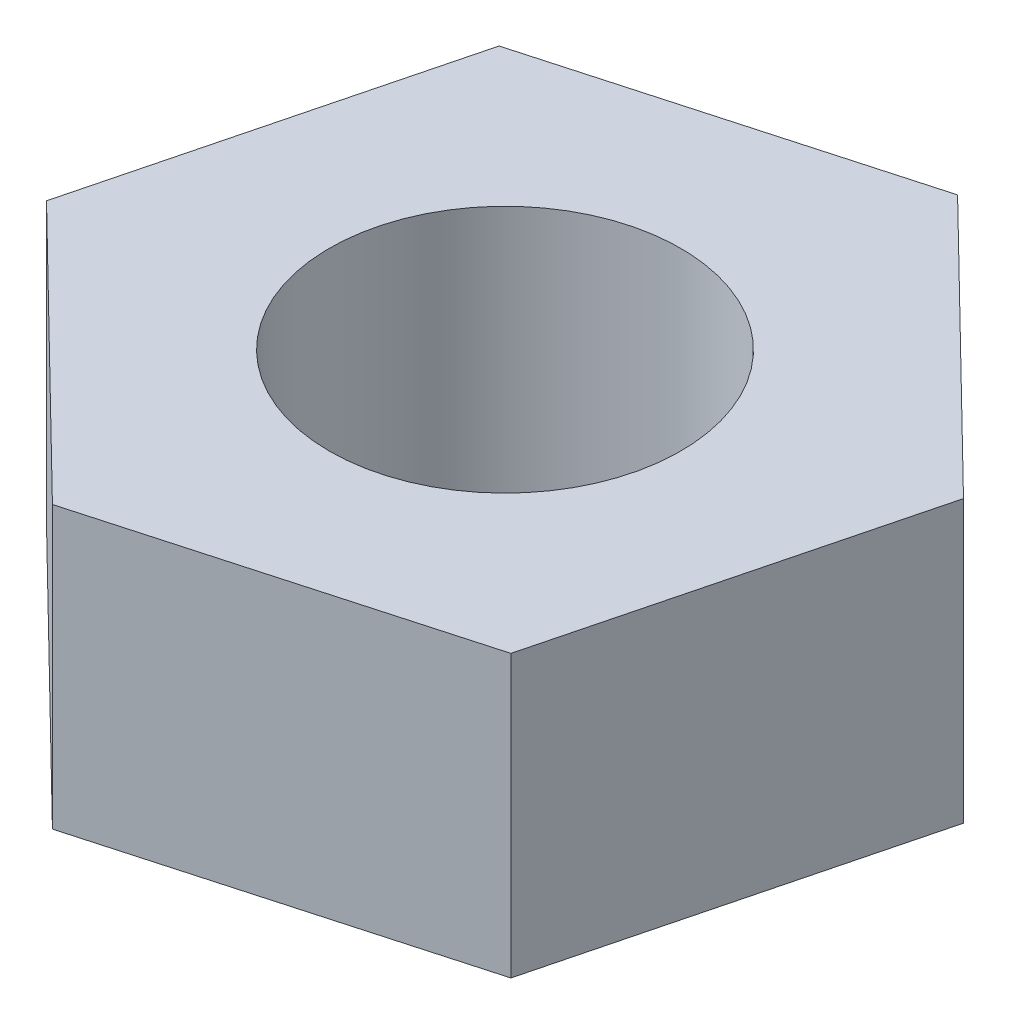
ISO-10303-21;
HEADER;
FILE_DESCRIPTION(('STEP AP214'),'2;1');
FILE_NAME('part.step','',(''),(''),'','','');
FILE_SCHEMA(('AUTOMOTIVE_DESIGN { 1 0 10303 214 1 1 1 1 }'));
ENDSEC;
DATA;
#1=APPLICATION_CONTEXT('core data for automotive mechanical design processes');
#2=APPLICATION_PROTOCOL_DEFINITION('international standard','automotive_design',2000,#1);
#3=PRODUCT_CONTEXT('',#1,'mechanical');
#4=PRODUCT('Part','Part','',(#3));
#5=PRODUCT_RELATED_PRODUCT_CATEGORY('part','',(#4));
#6=PRODUCT_DEFINITION_FORMATION('','',#4);
#7=PRODUCT_DEFINITION_CONTEXT('part definition',#1,'design');
#8=PRODUCT_DEFINITION('design','',#6,#7);
#9=PRODUCT_DEFINITION_SHAPE('','',#8);
#10=(LENGTH_UNIT() NAMED_UNIT(*) SI_UNIT(.MILLI.,.METRE.));
#11=(NAMED_UNIT(*) PLANE_ANGLE_UNIT() SI_UNIT($,.RADIAN.));
#12=(NAMED_UNIT(*) SI_UNIT($,.STERADIAN.) SOLID_ANGLE_UNIT());
#13=UNCERTAINTY_MEASURE_WITH_UNIT(LENGTH_MEASURE(1.E-05),#10,'distance_accuracy_value','');
#14=(GEOMETRIC_REPRESENTATION_CONTEXT(3) GLOBAL_UNCERTAINTY_ASSIGNED_CONTEXT((#13)) GLOBAL_UNIT_ASSIGNED_CONTEXT((#10,
#11,#12)) REPRESENTATION_CONTEXT('',''));
#15=CARTESIAN_POINT('',(0.,0.,0.));
#16=DIRECTION('',(0.,0.,1.));
#17=DIRECTION('',(1.,0.,0.));
#18=AXIS2_PLACEMENT_3D('',#15,#16,#17);
#19=CARTESIAN_POINT('',(0.,2.4,0.));
#20=DIRECTION('',(0.,1.,0.));
#21=DIRECTION('',(0.,0.,1.));
#22=AXIS2_PLACEMENT_3D('',#19,#20,#21);
#23=PLANE('',#22);
#24=DIRECTION('',(0.962956963986224,0.,-0.269655123278668));
#25=VECTOR('',#24,1.);
#26=CARTESIAN_POINT('',(-0.787347932516208,2.4,3.07626666049869));
#27=LINE('',#26,#25);
#28=CARTESIAN_POINT('',(-0.787347932516208,2.4,3.07626666049869));
#29=VERTEX_POINT('',#28);
#30=CARTESIAN_POINT('',(2.27045111054888,2.4,2.21999664142554));
#31=VERTEX_POINT('',#30);
#32=EDGE_CURVE('E146',#29,#31,#27,.T.);
#33=ORIENTED_EDGE('',*,*,#32,.T.);
#34=DIRECTION('',(0.247950294973161,0.,-0.968772755202541));
#35=VECTOR('',#34,1.);
#36=CARTESIAN_POINT('',(2.27045111054888,2.4,2.21999664142554));
#37=LINE('',#36,#35);
#38=CARTESIAN_POINT('',(3.05779904306509,2.4,-0.856270019073154));
#39=VERTEX_POINT('',#38);
#40=EDGE_CURVE('E94',#31,#39,#37,.T.);
#41=ORIENTED_EDGE('',*,*,#40,.T.);
#42=DIRECTION('',(-0.715006669013063,0.,-0.699117631923873));
#43=VECTOR('',#42,1.);
#44=CARTESIAN_POINT('',(3.05779904306509,2.4,-0.856270019073154));
#45=LINE('',#44,#43);
#46=CARTESIAN_POINT('',(0.787347932516208,2.4,-3.07626666049869));
#47=VERTEX_POINT('',#46);
#48=EDGE_CURVE('E107',#39,#47,#45,.T.);
#49=ORIENTED_EDGE('',*,*,#48,.T.);
#50=DIRECTION('',(-0.962956963986224,0.,0.269655123278668));
#51=VECTOR('',#50,1.);
#52=CARTESIAN_POINT('',(0.787347932516208,2.4,-3.07626666049869));
#53=LINE('',#52,#51);
#54=CARTESIAN_POINT('',(-2.27045111054888,2.4,-2.21999664142554));
#55=VERTEX_POINT('',#54);
#56=EDGE_CURVE('E101',#47,#55,#53,.T.);
#57=ORIENTED_EDGE('',*,*,#56,.T.);
#58=DIRECTION('',(-0.247950294973161,0.,0.968772755202541));
#59=VECTOR('',#58,1.);
#60=CARTESIAN_POINT('',(-2.27045111054888,2.4,-2.21999664142554));
#61=LINE('',#60,#59);
#62=CARTESIAN_POINT('',(-3.05779904306509,2.4,0.856270019073154));
#63=VERTEX_POINT('',#62);
#64=EDGE_CURVE('E105',#55,#63,#61,.T.);
#65=ORIENTED_EDGE('',*,*,#64,.T.);
#66=DIRECTION('',(0.715006669013063,0.,0.699117631923873));
#67=VECTOR('',#66,1.);
#68=CARTESIAN_POINT('',(-3.05779904306509,2.4,0.856270019073154));
#69=LINE('',#68,#67);
#70=EDGE_CURVE('E57',#63,#29,#69,.T.);
#71=ORIENTED_EDGE('',*,*,#70,.T.);
#72=EDGE_LOOP('',(#33,#41,#49,#57,#65,#71));
#73=FACE_BOUND('',#72,.T.);
#74=CARTESIAN_POINT('',(0.,2.4,0.));
#75=DIRECTION('',(0.,1.,0.));
#76=DIRECTION('',(0.,0.,1.));
#77=AXIS2_PLACEMENT_3D('',#74,#75,#76);
#78=CIRCLE('',#77,1.5);
#79=CARTESIAN_POINT('',(0.,2.4,1.5));
#80=VERTEX_POINT('',#79);
#81=EDGE_CURVE('E134',#80,#80,#78,.T.);
#82=ORIENTED_EDGE('',*,*,#81,.F.);
#83=EDGE_LOOP('',(#82));
#84=FACE_BOUND('',#83,.T.);
#85=ADVANCED_FACE('F39',(#73,#84),#23,.T.);
#86=CARTESIAN_POINT('',(0.,0.,0.));
#87=DIRECTION('',(0.,1.,0.));
#88=DIRECTION('',(0.,0.,1.));
#89=AXIS2_PLACEMENT_3D('',#86,#87,#88);
#90=PLANE('',#89);
#91=DIRECTION('',(0.962956963986224,0.,-0.269655123278668));
#92=VECTOR('',#91,1.);
#93=CARTESIAN_POINT('',(-0.787347932516208,0.,3.07626666049869));
#94=LINE('',#93,#92);
#95=CARTESIAN_POINT('',(-0.787347932516208,0.,3.07626666049869));
#96=VERTEX_POINT('',#95);
#97=CARTESIAN_POINT('',(2.27045111054888,0.,2.21999664142554));
#98=VERTEX_POINT('',#97);
#99=EDGE_CURVE('E129',#96,#98,#94,.T.);
#100=ORIENTED_EDGE('',*,*,#99,.F.);
#101=DIRECTION('',(0.715006669013063,0.,0.699117631923873));
#102=VECTOR('',#101,1.);
#103=CARTESIAN_POINT('',(-3.05779904306509,0.,0.856270019073154));
#104=LINE('',#103,#102);
#105=CARTESIAN_POINT('',(-3.05779904306509,0.,0.856270019073154));
#106=VERTEX_POINT('',#105);
#107=EDGE_CURVE('E86',#106,#96,#104,.T.);
#108=ORIENTED_EDGE('',*,*,#107,.F.);
#109=DIRECTION('',(-0.247950294973161,0.,0.968772755202541));
#110=VECTOR('',#109,1.);
#111=CARTESIAN_POINT('',(-2.27045111054888,0.,-2.21999664142554));
#112=LINE('',#111,#110);
#113=CARTESIAN_POINT('',(-2.27045111054888,0.,-2.21999664142554));
#114=VERTEX_POINT('',#113);
#115=EDGE_CURVE('E80',#114,#106,#112,.T.);
#116=ORIENTED_EDGE('',*,*,#115,.F.);
#117=DIRECTION('',(-0.962956963986224,0.,0.269655123278668));
#118=VECTOR('',#117,1.);
#119=CARTESIAN_POINT('',(0.787347932516208,0.,-3.07626666049869));
#120=LINE('',#119,#118);
#121=CARTESIAN_POINT('',(0.787347932516208,0.,-3.07626666049869));
#122=VERTEX_POINT('',#121);
#123=EDGE_CURVE('E116',#122,#114,#120,.T.);
#124=ORIENTED_EDGE('',*,*,#123,.F.);
#125=DIRECTION('',(-0.715006669013063,0.,-0.699117631923873));
#126=VECTOR('',#125,1.);
#127=CARTESIAN_POINT('',(3.05779904306509,0.,-0.856270019073154));
#128=LINE('',#127,#126);
#129=CARTESIAN_POINT('',(3.05779904306509,0.,-0.856270019073154));
#130=VERTEX_POINT('',#129);
#131=EDGE_CURVE('E137',#130,#122,#128,.T.);
#132=ORIENTED_EDGE('',*,*,#131,.F.);
#133=DIRECTION('',(0.247950294973161,0.,-0.968772755202541));
#134=VECTOR('',#133,1.);
#135=CARTESIAN_POINT('',(2.27045111054888,0.,2.21999664142554));
#136=LINE('',#135,#134);
#137=EDGE_CURVE('E133',#98,#130,#136,.T.);
#138=ORIENTED_EDGE('',*,*,#137,.F.);
#139=EDGE_LOOP('',(#100,#108,#116,#124,#132,#138));
#140=FACE_BOUND('',#139,.T.);
#141=CARTESIAN_POINT('',(0.,0.,0.));
#142=DIRECTION('',(0.,1.,0.));
#143=DIRECTION('',(0.,0.,1.));
#144=AXIS2_PLACEMENT_3D('',#141,#142,#143);
#145=CIRCLE('',#144,1.5);
#146=CARTESIAN_POINT('',(0.,0.,1.5));
#147=VERTEX_POINT('',#146);
#148=EDGE_CURVE('E243',#147,#147,#145,.T.);
#149=ORIENTED_EDGE('',*,*,#148,.T.);
#150=EDGE_LOOP('',(#149));
#151=FACE_BOUND('',#150,.T.);
#152=ADVANCED_FACE('F159',(#140,#151),#90,.F.);
#153=CARTESIAN_POINT('',(-0.787347932516208,2.4,3.07626666049869));
#154=DIRECTION('',(-0.269655123278668,0.,-0.962956963986224));
#155=DIRECTION('',(-0.962956963986224,0.,0.269655123278668));
#156=AXIS2_PLACEMENT_3D('',#153,#154,#155);
#157=PLANE('',#156);
#158=ORIENTED_EDGE('',*,*,#99,.T.);
#159=DIRECTION('',(0.,-1.,0.));
#160=VECTOR('',#159,1.);
#161=CARTESIAN_POINT('',(2.27045111054888,2.4,2.21999664142554));
#162=LINE('',#161,#160);
#163=EDGE_CURVE('E11',#31,#98,#162,.T.);
#164=ORIENTED_EDGE('',*,*,#163,.F.);
#165=ORIENTED_EDGE('',*,*,#32,.F.);
#166=DIRECTION('',(0.,-1.,0.));
#167=VECTOR('',#166,1.);
#168=CARTESIAN_POINT('',(-0.787347932516208,2.4,3.07626666049869));
#169=LINE('',#168,#167);
#170=EDGE_CURVE('E125',#29,#96,#169,.T.);
#171=ORIENTED_EDGE('',*,*,#170,.T.);
#172=EDGE_LOOP('',(#158,#164,#165,#171));
#173=FACE_BOUND('',#172,.T.);
#174=ADVANCED_FACE('F41',(#173),#157,.F.);
#175=CARTESIAN_POINT('',(2.27045111054888,2.4,2.21999664142554));
#176=DIRECTION('',(-0.968772755202541,0.,-0.247950294973161));
#177=DIRECTION('',(-0.247950294973161,0.,0.968772755202541));
#178=AXIS2_PLACEMENT_3D('',#175,#176,#177);
#179=PLANE('',#178);
#180=ORIENTED_EDGE('',*,*,#137,.T.);
#181=DIRECTION('',(0.,-1.,0.));
#182=VECTOR('',#181,1.);
#183=CARTESIAN_POINT('',(3.05779904306509,2.4,-0.856270019073154));
#184=LINE('',#183,#182);
#185=EDGE_CURVE('E49',#39,#130,#184,.T.);
#186=ORIENTED_EDGE('',*,*,#185,.F.);
#187=ORIENTED_EDGE('',*,*,#40,.F.);
#188=ORIENTED_EDGE('',*,*,#163,.T.);
#189=EDGE_LOOP('',(#180,#186,#187,#188));
#190=FACE_BOUND('',#189,.T.);
#191=ADVANCED_FACE('F184',(#190),#179,.F.);
#192=CARTESIAN_POINT('',(3.05779904306509,2.4,-0.856270019073154));
#193=DIRECTION('',(-0.699117631923873,0.,0.715006669013063));
#194=DIRECTION('',(0.715006669013063,0.,0.699117631923873));
#195=AXIS2_PLACEMENT_3D('',#192,#193,#194);
#196=PLANE('',#195);
#197=ORIENTED_EDGE('',*,*,#131,.T.);
#198=DIRECTION('',(0.,-1.,0.));
#199=VECTOR('',#198,1.);
#200=CARTESIAN_POINT('',(0.787347932516208,2.4,-3.07626666049869));
#201=LINE('',#200,#199);
#202=EDGE_CURVE('E118',#47,#122,#201,.T.);
#203=ORIENTED_EDGE('',*,*,#202,.F.);
#204=ORIENTED_EDGE('',*,*,#48,.F.);
#205=ORIENTED_EDGE('',*,*,#185,.T.);
#206=EDGE_LOOP('',(#197,#203,#204,#205));
#207=FACE_BOUND('',#206,.T.);
#208=ADVANCED_FACE('F156',(#207),#196,.F.);
#209=CARTESIAN_POINT('',(0.787347932516208,2.4,-3.07626666049869));
#210=DIRECTION('',(0.269655123278668,0.,0.962956963986224));
#211=DIRECTION('',(0.962956963986224,0.,-0.269655123278668));
#212=AXIS2_PLACEMENT_3D('',#209,#210,#211);
#213=PLANE('',#212);
#214=ORIENTED_EDGE('',*,*,#123,.T.);
#215=DIRECTION('',(0.,-1.,0.));
#216=VECTOR('',#215,1.);
#217=CARTESIAN_POINT('',(-2.27045111054888,2.4,-2.21999664142554));
#218=LINE('',#217,#216);
#219=EDGE_CURVE('E113',#55,#114,#218,.T.);
#220=ORIENTED_EDGE('',*,*,#219,.F.);
#221=ORIENTED_EDGE('',*,*,#56,.F.);
#222=ORIENTED_EDGE('',*,*,#202,.T.);
#223=EDGE_LOOP('',(#214,#220,#221,#222));
#224=FACE_BOUND('',#223,.T.);
#225=ADVANCED_FACE('F114',(#224),#213,.F.);
#226=CARTESIAN_POINT('',(-2.27045111054888,2.4,-2.21999664142554));
#227=DIRECTION('',(0.968772755202541,0.,0.247950294973161));
#228=DIRECTION('',(0.247950294973161,0.,-0.968772755202541));
#229=AXIS2_PLACEMENT_3D('',#226,#227,#228);
#230=PLANE('',#229);
#231=ORIENTED_EDGE('',*,*,#115,.T.);
#232=DIRECTION('',(0.,-1.,0.));
#233=VECTOR('',#232,1.);
#234=CARTESIAN_POINT('',(-3.05779904306509,2.4,0.856270019073154));
#235=LINE('',#234,#233);
#236=EDGE_CURVE('E119',#63,#106,#235,.T.);
#237=ORIENTED_EDGE('',*,*,#236,.F.);
#238=ORIENTED_EDGE('',*,*,#64,.F.);
#239=ORIENTED_EDGE('',*,*,#219,.T.);
#240=EDGE_LOOP('',(#231,#237,#238,#239));
#241=FACE_BOUND('',#240,.T.);
#242=ADVANCED_FACE('F121',(#241),#230,.F.);
#243=CARTESIAN_POINT('',(-3.05779904306509,2.4,0.856270019073154));
#244=DIRECTION('',(0.699117631923873,0.,-0.715006669013063));
#245=DIRECTION('',(-0.715006669013063,0.,-0.699117631923873));
#246=AXIS2_PLACEMENT_3D('',#243,#244,#245);
#247=PLANE('',#246);
#248=ORIENTED_EDGE('',*,*,#107,.T.);
#249=ORIENTED_EDGE('',*,*,#170,.F.);
#250=ORIENTED_EDGE('',*,*,#70,.F.);
#251=ORIENTED_EDGE('',*,*,#236,.T.);
#252=EDGE_LOOP('',(#248,#249,#250,#251));
#253=FACE_BOUND('',#252,.T.);
#254=ADVANCED_FACE('F164',(#253),#247,.F.);
#255=CARTESIAN_POINT('',(0.,2.4,0.));
#256=DIRECTION('',(0.,-1.,0.));
#257=DIRECTION('',(0.,0.,-1.));
#258=AXIS2_PLACEMENT_3D('',#255,#256,#257);
#259=CYLINDRICAL_SURFACE('',#258,1.5);
#260=ORIENTED_EDGE('',*,*,#81,.T.);
#261=EDGE_LOOP('',(#260));
#262=FACE_BOUND('',#261,.T.);
#263=ORIENTED_EDGE('',*,*,#148,.F.);
#264=EDGE_LOOP('',(#263));
#265=FACE_BOUND('',#264,.T.);
#266=ADVANCED_FACE('F166',(#262,#265),#259,.F.);
#267=CLOSED_SHELL('',(#85,#152,#174,#191,#208,#225,#242,#254,#266));
#268=MANIFOLD_SOLID_BREP('B2',#267);
#269=ADVANCED_BREP_SHAPE_REPRESENTATION('',(#18,#268),#14);
#270=SHAPE_DEFINITION_REPRESENTATION(#9,#269);
ENDSEC;
END-ISO-10303-21;
